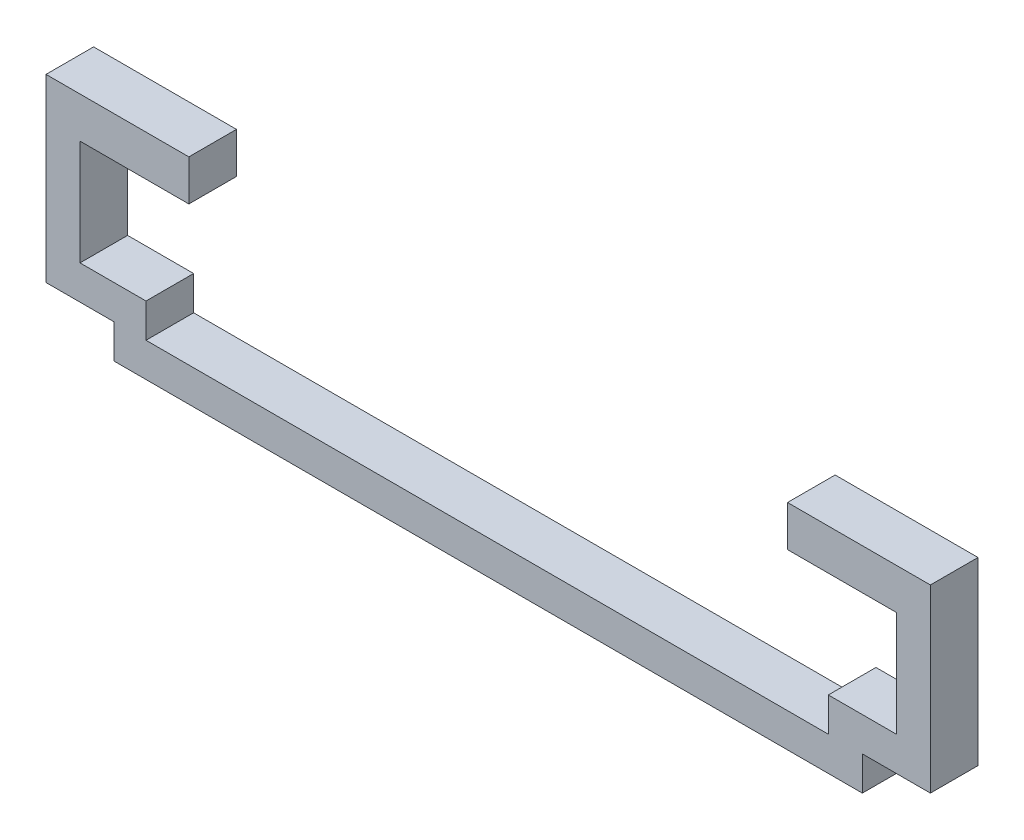
ISO-10303-21;
HEADER;
FILE_DESCRIPTION(('STEP AP214'),'2;1');
FILE_NAME('part.step','',(''),(''),'','','');
FILE_SCHEMA(('AUTOMOTIVE_DESIGN { 1 0 10303 214 1 1 1 1 }'));
ENDSEC;
DATA;
#1=APPLICATION_CONTEXT('core data for automotive mechanical design processes');
#2=APPLICATION_PROTOCOL_DEFINITION('international standard','automotive_design',2000,#1);
#3=PRODUCT_CONTEXT('',#1,'mechanical');
#4=PRODUCT('Part','Part','',(#3));
#5=PRODUCT_RELATED_PRODUCT_CATEGORY('part','',(#4));
#6=PRODUCT_DEFINITION_FORMATION('','',#4);
#7=PRODUCT_DEFINITION_CONTEXT('part definition',#1,'design');
#8=PRODUCT_DEFINITION('design','',#6,#7);
#9=PRODUCT_DEFINITION_SHAPE('','',#8);
#10=(LENGTH_UNIT() NAMED_UNIT(*) SI_UNIT(.MILLI.,.METRE.));
#11=(NAMED_UNIT(*) PLANE_ANGLE_UNIT() SI_UNIT($,.RADIAN.));
#12=(NAMED_UNIT(*) SI_UNIT($,.STERADIAN.) SOLID_ANGLE_UNIT());
#13=UNCERTAINTY_MEASURE_WITH_UNIT(LENGTH_MEASURE(1.E-05),#10,'distance_accuracy_value','');
#14=(GEOMETRIC_REPRESENTATION_CONTEXT(3) GLOBAL_UNCERTAINTY_ASSIGNED_CONTEXT((#13)) GLOBAL_UNIT_ASSIGNED_CONTEXT((#10,
#11,#12)) REPRESENTATION_CONTEXT('',''));
#15=CARTESIAN_POINT('',(0.,0.,0.));
#16=DIRECTION('',(0.,0.,1.));
#17=DIRECTION('',(1.,0.,0.));
#18=AXIS2_PLACEMENT_3D('',#15,#16,#17);
#19=CARTESIAN_POINT('',(55.,-2.5,8.8));
#20=DIRECTION('',(1.,0.,0.));
#21=DIRECTION('',(0.,0.,-1.));
#22=AXIS2_PLACEMENT_3D('',#19,#20,#21);
#23=PLANE('',#22);
#24=DIRECTION('',(0.,1.,0.));
#25=VECTOR('',#24,1.);
#26=CARTESIAN_POINT('',(55.,-2.5,7.));
#27=LINE('',#26,#25);
#28=CARTESIAN_POINT('',(55.,-2.5,7.));
#29=VERTEX_POINT('',#28);
#30=CARTESIAN_POINT('',(55.,2.5,7.));
#31=VERTEX_POINT('',#30);
#32=EDGE_CURVE('E249',#29,#31,#27,.T.);
#33=ORIENTED_EDGE('',*,*,#32,.F.);
#34=DIRECTION('',(0.,0.,-1.));
#35=VECTOR('',#34,1.);
#36=CARTESIAN_POINT('',(55.,-2.5,8.8));
#37=LINE('',#36,#35);
#38=CARTESIAN_POINT('',(55.,-2.5,0.));
#39=VERTEX_POINT('',#38);
#40=EDGE_CURVE('E382',#29,#39,#37,.T.);
#41=ORIENTED_EDGE('',*,*,#40,.T.);
#42=DIRECTION('',(0.,-1.,0.));
#43=VECTOR('',#42,1.);
#44=CARTESIAN_POINT('',(55.,-2.5,0.));
#45=LINE('',#44,#43);
#46=CARTESIAN_POINT('',(55.,2.5,0.));
#47=VERTEX_POINT('',#46);
#48=EDGE_CURVE('E377',#47,#39,#45,.T.);
#49=ORIENTED_EDGE('',*,*,#48,.F.);
#50=DIRECTION('',(0.,0.,1.));
#51=VECTOR('',#50,1.);
#52=CARTESIAN_POINT('',(55.,2.5,0.));
#53=LINE('',#52,#51);
#54=EDGE_CURVE('E342',#47,#31,#53,.T.);
#55=ORIENTED_EDGE('',*,*,#54,.T.);
#56=EDGE_LOOP('',(#33,#41,#49,#55));
#57=FACE_BOUND('',#56,.T.);
#58=ADVANCED_FACE('F39',(#57),#23,.T.);
#59=CARTESIAN_POINT('',(-50.,2.5,8.8));
#60=DIRECTION('',(0.,-1.,0.));
#61=DIRECTION('',(0.,0.,-1.));
#62=AXIS2_PLACEMENT_3D('',#59,#60,#61);
#63=PLANE('',#62);
#64=DIRECTION('',(0.,0.,1.));
#65=VECTOR('',#64,1.);
#66=CARTESIAN_POINT('',(-50.3,2.5,0.));
#67=LINE('',#66,#65);
#68=CARTESIAN_POINT('',(-50.3,2.5,0.));
#69=VERTEX_POINT('',#68);
#70=CARTESIAN_POINT('',(-50.3,2.5,7.));
#71=VERTEX_POINT('',#70);
#72=EDGE_CURVE('E333',#69,#71,#67,.T.);
#73=ORIENTED_EDGE('',*,*,#72,.T.);
#74=DIRECTION('',(-1.,0.,0.));
#75=VECTOR('',#74,1.);
#76=CARTESIAN_POINT('',(50.,2.5,7.));
#77=LINE('',#76,#75);
#78=CARTESIAN_POINT('',(50.,2.5,7.));
#79=VERTEX_POINT('',#78);
#80=EDGE_CURVE('E268',#79,#71,#77,.T.);
#81=ORIENTED_EDGE('',*,*,#80,.F.);
#82=DIRECTION('',(0.,0.,-1.));
#83=VECTOR('',#82,1.);
#84=CARTESIAN_POINT('',(50.,2.5,8.8));
#85=LINE('',#84,#83);
#86=CARTESIAN_POINT('',(50.,2.5,0.));
#87=VERTEX_POINT('',#86);
#88=EDGE_CURVE('E11',#79,#87,#85,.T.);
#89=ORIENTED_EDGE('',*,*,#88,.T.);
#90=DIRECTION('',(-1.,0.,0.));
#91=VECTOR('',#90,1.);
#92=CARTESIAN_POINT('',(-50.,2.5,0.));
#93=LINE('',#92,#91);
#94=EDGE_CURVE('E385',#87,#69,#93,.T.);
#95=ORIENTED_EDGE('',*,*,#94,.T.);
#96=EDGE_LOOP('',(#73,#81,#89,#95));
#97=FACE_BOUND('',#96,.T.);
#98=ADVANCED_FACE('F41',(#97),#63,.F.);
#99=CARTESIAN_POINT('',(-50.,-2.5,8.8));
#100=DIRECTION('',(0.,1.,0.));
#101=DIRECTION('',(0.,0.,1.));
#102=AXIS2_PLACEMENT_3D('',#99,#100,#101);
#103=PLANE('',#102);
#104=ORIENTED_EDGE('',*,*,#40,.F.);
#105=DIRECTION('',(1.,0.,0.));
#106=VECTOR('',#105,1.);
#107=CARTESIAN_POINT('',(-55.,-2.5,7.));
#108=LINE('',#107,#106);
#109=CARTESIAN_POINT('',(-55.,-2.5,7.));
#110=VERTEX_POINT('',#109);
#111=EDGE_CURVE('E246',#110,#29,#108,.T.);
#112=ORIENTED_EDGE('',*,*,#111,.F.);
#113=DIRECTION('',(0.,0.,-1.));
#114=VECTOR('',#113,1.);
#115=CARTESIAN_POINT('',(-55.,-2.5,8.8));
#116=LINE('',#115,#114);
#117=CARTESIAN_POINT('',(-55.,-2.5,0.));
#118=VERTEX_POINT('',#117);
#119=EDGE_CURVE('E367',#110,#118,#116,.T.);
#120=ORIENTED_EDGE('',*,*,#119,.T.);
#121=DIRECTION('',(1.,0.,0.));
#122=VECTOR('',#121,1.);
#123=CARTESIAN_POINT('',(-50.,-2.5,0.));
#124=LINE('',#123,#122);
#125=EDGE_CURVE('E48',#118,#39,#124,.T.);
#126=ORIENTED_EDGE('',*,*,#125,.T.);
#127=EDGE_LOOP('',(#104,#112,#120,#126));
#128=FACE_BOUND('',#127,.T.);
#129=ADVANCED_FACE('F394',(#128),#103,.F.);
#130=CARTESIAN_POINT('',(0.,0.,0.));
#131=DIRECTION('',(0.,0.,1.));
#132=DIRECTION('',(1.,0.,0.));
#133=AXIS2_PLACEMENT_3D('',#130,#131,#132);
#134=PLANE('',#133);
#135=DIRECTION('',(1.,0.,0.));
#136=VECTOR('',#135,1.);
#137=CARTESIAN_POINT('',(65.,23.,0.));
#138=LINE('',#137,#136);
#139=CARTESIAN_POINT('',(44.,23.,0.));
#140=VERTEX_POINT('',#139);
#141=CARTESIAN_POINT('',(60.,23.,0.));
#142=VERTEX_POINT('',#141);
#143=EDGE_CURVE('E282',#140,#142,#138,.T.);
#144=ORIENTED_EDGE('',*,*,#143,.F.);
#145=DIRECTION('',(0.,-1.,0.));
#146=VECTOR('',#145,1.);
#147=CARTESIAN_POINT('',(44.,29.,0.));
#148=LINE('',#147,#146);
#149=CARTESIAN_POINT('',(44.,29.,0.));
#150=VERTEX_POINT('',#149);
#151=EDGE_CURVE('E202',#150,#140,#148,.T.);
#152=ORIENTED_EDGE('',*,*,#151,.F.);
#153=DIRECTION('',(-1.,0.,0.));
#154=VECTOR('',#153,1.);
#155=CARTESIAN_POINT('',(65.,29.,0.));
#156=LINE('',#155,#154);
#157=CARTESIAN_POINT('',(65.,29.,0.));
#158=VERTEX_POINT('',#157);
#159=EDGE_CURVE('E197',#158,#150,#156,.T.);
#160=ORIENTED_EDGE('',*,*,#159,.F.);
#161=DIRECTION('',(0.,1.,0.));
#162=VECTOR('',#161,1.);
#163=CARTESIAN_POINT('',(65.,2.5,0.));
#164=LINE('',#163,#162);
#165=CARTESIAN_POINT('',(65.,2.5,0.));
#166=VERTEX_POINT('',#165);
#167=EDGE_CURVE('E303',#166,#158,#164,.T.);
#168=ORIENTED_EDGE('',*,*,#167,.F.);
#169=DIRECTION('',(1.,0.,0.));
#170=VECTOR('',#169,1.);
#171=CARTESIAN_POINT('',(55.,2.5,0.));
#172=LINE('',#171,#170);
#173=EDGE_CURVE('E337',#47,#166,#172,.T.);
#174=ORIENTED_EDGE('',*,*,#173,.F.);
#175=ORIENTED_EDGE('',*,*,#48,.T.);
#176=ORIENTED_EDGE('',*,*,#125,.F.);
#177=DIRECTION('',(0.,1.,0.));
#178=VECTOR('',#177,1.);
#179=CARTESIAN_POINT('',(-55.,-2.5,0.));
#180=LINE('',#179,#178);
#181=CARTESIAN_POINT('',(-55.,2.5,0.));
#182=VERTEX_POINT('',#181);
#183=EDGE_CURVE('E357',#118,#182,#180,.T.);
#184=ORIENTED_EDGE('',*,*,#183,.T.);
#185=DIRECTION('',(1.,0.,0.));
#186=VECTOR('',#185,1.);
#187=CARTESIAN_POINT('',(-55.,2.5,0.));
#188=LINE('',#187,#186);
#189=CARTESIAN_POINT('',(-65.,2.5,0.));
#190=VERTEX_POINT('',#189);
#191=EDGE_CURVE('E347',#190,#182,#188,.T.);
#192=ORIENTED_EDGE('',*,*,#191,.F.);
#193=DIRECTION('',(0.,-1.,0.));
#194=VECTOR('',#193,1.);
#195=CARTESIAN_POINT('',(-65.,2.5,0.));
#196=LINE('',#195,#194);
#197=CARTESIAN_POINT('',(-65.,29.,0.));
#198=VERTEX_POINT('',#197);
#199=EDGE_CURVE('E318',#198,#190,#196,.T.);
#200=ORIENTED_EDGE('',*,*,#199,.F.);
#201=DIRECTION('',(-1.,0.,0.));
#202=VECTOR('',#201,1.);
#203=CARTESIAN_POINT('',(-65.,29.,0.));
#204=LINE('',#203,#202);
#205=CARTESIAN_POINT('',(-44.,29.,0.));
#206=VERTEX_POINT('',#205);
#207=EDGE_CURVE('E291',#206,#198,#204,.T.);
#208=ORIENTED_EDGE('',*,*,#207,.F.);
#209=DIRECTION('',(0.,1.,0.));
#210=VECTOR('',#209,1.);
#211=CARTESIAN_POINT('',(-44.,29.,0.));
#212=LINE('',#211,#210);
#213=CARTESIAN_POINT('',(-44.,23.,0.));
#214=VERTEX_POINT('',#213);
#215=EDGE_CURVE('E223',#214,#206,#212,.T.);
#216=ORIENTED_EDGE('',*,*,#215,.F.);
#217=DIRECTION('',(1.,0.,0.));
#218=VECTOR('',#217,1.);
#219=CARTESIAN_POINT('',(-65.,23.,0.));
#220=LINE('',#219,#218);
#221=CARTESIAN_POINT('',(-60.,23.,0.));
#222=VERTEX_POINT('',#221);
#223=EDGE_CURVE('E288',#222,#214,#220,.T.);
#224=ORIENTED_EDGE('',*,*,#223,.F.);
#225=DIRECTION('',(0.,1.,0.));
#226=VECTOR('',#225,1.);
#227=CARTESIAN_POINT('',(-60.,2.5,0.));
#228=LINE('',#227,#226);
#229=CARTESIAN_POINT('',(-60.,7.5,0.));
#230=VERTEX_POINT('',#229);
#231=EDGE_CURVE('E311',#230,#222,#228,.T.);
#232=ORIENTED_EDGE('',*,*,#231,.F.);
#233=DIRECTION('',(1.,0.,0.));
#234=VECTOR('',#233,1.);
#235=CARTESIAN_POINT('',(-50.,7.5,0.));
#236=LINE('',#235,#234);
#237=CARTESIAN_POINT('',(-50.3,7.5,0.));
#238=VERTEX_POINT('',#237);
#239=EDGE_CURVE('E363',#230,#238,#236,.T.);
#240=ORIENTED_EDGE('',*,*,#239,.T.);
#241=DIRECTION('',(0.,-1.,0.));
#242=VECTOR('',#241,1.);
#243=CARTESIAN_POINT('',(-50.3,7.5,0.));
#244=LINE('',#243,#242);
#245=EDGE_CURVE('E55',#238,#69,#244,.T.);
#246=ORIENTED_EDGE('',*,*,#245,.T.);
#247=ORIENTED_EDGE('',*,*,#94,.F.);
#248=DIRECTION('',(0.,1.,0.));
#249=VECTOR('',#248,1.);
#250=CARTESIAN_POINT('',(50.,-2.5,0.));
#251=LINE('',#250,#249);
#252=CARTESIAN_POINT('',(50.,7.5,0.));
#253=VERTEX_POINT('',#252);
#254=EDGE_CURVE('E370',#87,#253,#251,.T.);
#255=ORIENTED_EDGE('',*,*,#254,.T.);
#256=DIRECTION('',(1.,0.,0.));
#257=VECTOR('',#256,1.);
#258=CARTESIAN_POINT('',(50.,7.5,0.));
#259=LINE('',#258,#257);
#260=CARTESIAN_POINT('',(60.,7.5,0.));
#261=VERTEX_POINT('',#260);
#262=EDGE_CURVE('E374',#253,#261,#259,.T.);
#263=ORIENTED_EDGE('',*,*,#262,.T.);
#264=DIRECTION('',(0.,-1.,0.));
#265=VECTOR('',#264,1.);
#266=CARTESIAN_POINT('',(60.,2.5,0.));
#267=LINE('',#266,#265);
#268=EDGE_CURVE('E299',#142,#261,#267,.T.);
#269=ORIENTED_EDGE('',*,*,#268,.F.);
#270=EDGE_LOOP('',(#144,#152,#160,#168,#174,#175,#176,#184,#192,#200,#208,#216,#224,#232,#240,
#246,#247,#255,#263,#269));
#271=FACE_BOUND('',#270,.T.);
#272=ADVANCED_FACE('F398',(#271),#134,.F.);
#273=CARTESIAN_POINT('',(50.,-2.5,8.8));
#274=DIRECTION('',(-1.,0.,0.));
#275=DIRECTION('',(0.,0.,1.));
#276=AXIS2_PLACEMENT_3D('',#273,#274,#275);
#277=PLANE('',#276);
#278=DIRECTION('',(0.,-1.,0.));
#279=VECTOR('',#278,1.);
#280=CARTESIAN_POINT('',(50.,7.5,7.));
#281=LINE('',#280,#279);
#282=CARTESIAN_POINT('',(50.,7.5,7.));
#283=VERTEX_POINT('',#282);
#284=EDGE_CURVE('E265',#283,#79,#281,.T.);
#285=ORIENTED_EDGE('',*,*,#284,.F.);
#286=DIRECTION('',(0.,0.,-1.));
#287=VECTOR('',#286,1.);
#288=CARTESIAN_POINT('',(50.,7.5,8.8));
#289=LINE('',#288,#287);
#290=EDGE_CURVE('E381',#283,#253,#289,.T.);
#291=ORIENTED_EDGE('',*,*,#290,.T.);
#292=ORIENTED_EDGE('',*,*,#254,.F.);
#293=ORIENTED_EDGE('',*,*,#88,.F.);
#294=EDGE_LOOP('',(#285,#291,#292,#293));
#295=FACE_BOUND('',#294,.T.);
#296=ADVANCED_FACE('F440',(#295),#277,.T.);
#297=CARTESIAN_POINT('',(50.,7.5,8.8));
#298=DIRECTION('',(0.,1.,0.));
#299=DIRECTION('',(0.,0.,1.));
#300=AXIS2_PLACEMENT_3D('',#297,#298,#299);
#301=PLANE('',#300);
#302=DIRECTION('',(-1.,0.,0.));
#303=VECTOR('',#302,1.);
#304=CARTESIAN_POINT('',(60.,7.5,7.));
#305=LINE('',#304,#303);
#306=CARTESIAN_POINT('',(60.,7.5,7.));
#307=VERTEX_POINT('',#306);
#308=EDGE_CURVE('E262',#307,#283,#305,.T.);
#309=ORIENTED_EDGE('',*,*,#308,.F.);
#310=DIRECTION('',(0.,0.,1.));
#311=VECTOR('',#310,1.);
#312=CARTESIAN_POINT('',(60.,7.5,0.));
#313=LINE('',#312,#311);
#314=EDGE_CURVE('E343',#261,#307,#313,.T.);
#315=ORIENTED_EDGE('',*,*,#314,.F.);
#316=ORIENTED_EDGE('',*,*,#262,.F.);
#317=ORIENTED_EDGE('',*,*,#290,.F.);
#318=EDGE_LOOP('',(#309,#315,#316,#317));
#319=FACE_BOUND('',#318,.T.);
#320=ADVANCED_FACE('F444',(#319),#301,.T.);
#321=CARTESIAN_POINT('',(-50.,7.5,8.8));
#322=DIRECTION('',(0.,1.,0.));
#323=DIRECTION('',(0.,0.,1.));
#324=AXIS2_PLACEMENT_3D('',#321,#322,#323);
#325=PLANE('',#324);
#326=DIRECTION('',(-1.,0.,0.));
#327=VECTOR('',#326,1.);
#328=CARTESIAN_POINT('',(-50.3,7.5,7.));
#329=LINE('',#328,#327);
#330=CARTESIAN_POINT('',(-50.3,7.5,7.));
#331=VERTEX_POINT('',#330);
#332=CARTESIAN_POINT('',(-60.,7.5,7.));
#333=VERTEX_POINT('',#332);
#334=EDGE_CURVE('E274',#331,#333,#329,.T.);
#335=ORIENTED_EDGE('',*,*,#334,.F.);
#336=DIRECTION('',(0.,0.,1.));
#337=VECTOR('',#336,1.);
#338=CARTESIAN_POINT('',(-50.3,7.5,0.));
#339=LINE('',#338,#337);
#340=EDGE_CURVE('E332',#238,#331,#339,.T.);
#341=ORIENTED_EDGE('',*,*,#340,.F.);
#342=ORIENTED_EDGE('',*,*,#239,.F.);
#343=DIRECTION('',(0.,0.,1.));
#344=VECTOR('',#343,1.);
#345=CARTESIAN_POINT('',(-60.,7.5,0.));
#346=LINE('',#345,#344);
#347=EDGE_CURVE('E354',#230,#333,#346,.T.);
#348=ORIENTED_EDGE('',*,*,#347,.T.);
#349=EDGE_LOOP('',(#335,#341,#342,#348));
#350=FACE_BOUND('',#349,.T.);
#351=ADVANCED_FACE('F429',(#350),#325,.T.);
#352=CARTESIAN_POINT('',(-55.,-2.5,8.8));
#353=DIRECTION('',(-1.,0.,0.));
#354=DIRECTION('',(0.,0.,1.));
#355=AXIS2_PLACEMENT_3D('',#352,#353,#354);
#356=PLANE('',#355);
#357=DIRECTION('',(0.,-1.,0.));
#358=VECTOR('',#357,1.);
#359=CARTESIAN_POINT('',(-55.,2.5,7.));
#360=LINE('',#359,#358);
#361=CARTESIAN_POINT('',(-55.,2.5,7.));
#362=VERTEX_POINT('',#361);
#363=EDGE_CURVE('E243',#362,#110,#360,.T.);
#364=ORIENTED_EDGE('',*,*,#363,.F.);
#365=DIRECTION('',(0.,0.,1.));
#366=VECTOR('',#365,1.);
#367=CARTESIAN_POINT('',(-55.,2.5,0.));
#368=LINE('',#367,#366);
#369=EDGE_CURVE('E63',#182,#362,#368,.T.);
#370=ORIENTED_EDGE('',*,*,#369,.F.);
#371=ORIENTED_EDGE('',*,*,#183,.F.);
#372=ORIENTED_EDGE('',*,*,#119,.F.);
#373=EDGE_LOOP('',(#364,#370,#371,#372));
#374=FACE_BOUND('',#373,.T.);
#375=ADVANCED_FACE('F401',(#374),#356,.T.);
#376=CARTESIAN_POINT('',(-55.,2.5,0.));
#377=DIRECTION('',(0.,-1.,0.));
#378=DIRECTION('',(0.,0.,-1.));
#379=AXIS2_PLACEMENT_3D('',#376,#377,#378);
#380=PLANE('',#379);
#381=DIRECTION('',(1.,0.,0.));
#382=VECTOR('',#381,1.);
#383=CARTESIAN_POINT('',(-65.,2.5,7.));
#384=LINE('',#383,#382);
#385=CARTESIAN_POINT('',(-65.,2.5,7.));
#386=VERTEX_POINT('',#385);
#387=EDGE_CURVE('E240',#386,#362,#384,.T.);
#388=ORIENTED_EDGE('',*,*,#387,.F.);
#389=DIRECTION('',(0.,0.,1.));
#390=VECTOR('',#389,1.);
#391=CARTESIAN_POINT('',(-65.,2.5,0.));
#392=LINE('',#391,#390);
#393=EDGE_CURVE('E323',#190,#386,#392,.T.);
#394=ORIENTED_EDGE('',*,*,#393,.F.);
#395=ORIENTED_EDGE('',*,*,#191,.T.);
#396=ORIENTED_EDGE('',*,*,#369,.T.);
#397=EDGE_LOOP('',(#388,#394,#395,#396));
#398=FACE_BOUND('',#397,.T.);
#399=ADVANCED_FACE('F404',(#398),#380,.T.);
#400=CARTESIAN_POINT('',(55.,2.5,0.));
#401=DIRECTION('',(0.,-1.,0.));
#402=DIRECTION('',(0.,0.,-1.));
#403=AXIS2_PLACEMENT_3D('',#400,#401,#402);
#404=PLANE('',#403);
#405=DIRECTION('',(1.,0.,0.));
#406=VECTOR('',#405,1.);
#407=CARTESIAN_POINT('',(55.,2.5,7.));
#408=LINE('',#407,#406);
#409=CARTESIAN_POINT('',(65.,2.5,7.));
#410=VERTEX_POINT('',#409);
#411=EDGE_CURVE('E252',#31,#410,#408,.T.);
#412=ORIENTED_EDGE('',*,*,#411,.F.);
#413=ORIENTED_EDGE('',*,*,#54,.F.);
#414=ORIENTED_EDGE('',*,*,#173,.T.);
#415=DIRECTION('',(0.,0.,1.));
#416=VECTOR('',#415,1.);
#417=CARTESIAN_POINT('',(65.,2.5,0.));
#418=LINE('',#417,#416);
#419=EDGE_CURVE('E306',#166,#410,#418,.T.);
#420=ORIENTED_EDGE('',*,*,#419,.T.);
#421=EDGE_LOOP('',(#412,#413,#414,#420));
#422=FACE_BOUND('',#421,.T.);
#423=ADVANCED_FACE('F511',(#422),#404,.T.);
#424=CARTESIAN_POINT('',(-50.3,7.5,0.));
#425=DIRECTION('',(-1.,0.,0.));
#426=DIRECTION('',(0.,0.,1.));
#427=AXIS2_PLACEMENT_3D('',#424,#425,#426);
#428=PLANE('',#427);
#429=ORIENTED_EDGE('',*,*,#340,.T.);
#430=DIRECTION('',(0.,1.,0.));
#431=VECTOR('',#430,1.);
#432=CARTESIAN_POINT('',(-50.3,2.5,7.));
#433=LINE('',#432,#431);
#434=EDGE_CURVE('E271',#71,#331,#433,.T.);
#435=ORIENTED_EDGE('',*,*,#434,.F.);
#436=ORIENTED_EDGE('',*,*,#72,.F.);
#437=ORIENTED_EDGE('',*,*,#245,.F.);
#438=EDGE_LOOP('',(#429,#435,#436,#437));
#439=FACE_BOUND('',#438,.T.);
#440=ADVANCED_FACE('F437',(#439),#428,.F.);
#441=CARTESIAN_POINT('',(-60.,2.5,0.));
#442=DIRECTION('',(1.,0.,0.));
#443=DIRECTION('',(0.,0.,-1.));
#444=AXIS2_PLACEMENT_3D('',#441,#442,#443);
#445=PLANE('',#444);
#446=DIRECTION('',(0.,1.,0.));
#447=VECTOR('',#446,1.);
#448=CARTESIAN_POINT('',(-60.,7.5,7.));
#449=LINE('',#448,#447);
#450=CARTESIAN_POINT('',(-60.,23.,7.));
#451=VERTEX_POINT('',#450);
#452=EDGE_CURVE('E277',#333,#451,#449,.T.);
#453=ORIENTED_EDGE('',*,*,#452,.F.);
#454=ORIENTED_EDGE('',*,*,#347,.F.);
#455=ORIENTED_EDGE('',*,*,#231,.T.);
#456=DIRECTION('',(0.,0.,1.));
#457=VECTOR('',#456,1.);
#458=CARTESIAN_POINT('',(-60.,23.,0.));
#459=LINE('',#458,#457);
#460=EDGE_CURVE('E322',#222,#451,#459,.T.);
#461=ORIENTED_EDGE('',*,*,#460,.T.);
#462=EDGE_LOOP('',(#453,#454,#455,#461));
#463=FACE_BOUND('',#462,.T.);
#464=ADVANCED_FACE('F426',(#463),#445,.T.);
#465=CARTESIAN_POINT('',(-65.,2.5,0.));
#466=DIRECTION('',(-1.,0.,0.));
#467=DIRECTION('',(0.,0.,1.));
#468=AXIS2_PLACEMENT_3D('',#465,#466,#467);
#469=PLANE('',#468);
#470=DIRECTION('',(0.,-1.,0.));
#471=VECTOR('',#470,1.);
#472=CARTESIAN_POINT('',(-65.,29.,7.));
#473=LINE('',#472,#471);
#474=CARTESIAN_POINT('',(-65.,29.,7.));
#475=VERTEX_POINT('',#474);
#476=EDGE_CURVE('E237',#475,#386,#473,.T.);
#477=ORIENTED_EDGE('',*,*,#476,.F.);
#478=DIRECTION('',(0.,0.,1.));
#479=VECTOR('',#478,1.);
#480=CARTESIAN_POINT('',(-65.,29.,0.));
#481=LINE('',#480,#479);
#482=EDGE_CURVE('E295',#198,#475,#481,.T.);
#483=ORIENTED_EDGE('',*,*,#482,.F.);
#484=ORIENTED_EDGE('',*,*,#199,.T.);
#485=ORIENTED_EDGE('',*,*,#393,.T.);
#486=EDGE_LOOP('',(#477,#483,#484,#485));
#487=FACE_BOUND('',#486,.T.);
#488=ADVANCED_FACE('F410',(#487),#469,.T.);
#489=CARTESIAN_POINT('',(60.,2.5,0.));
#490=DIRECTION('',(-1.,0.,0.));
#491=DIRECTION('',(0.,0.,1.));
#492=AXIS2_PLACEMENT_3D('',#489,#490,#491);
#493=PLANE('',#492);
#494=DIRECTION('',(0.,-1.,0.));
#495=VECTOR('',#494,1.);
#496=CARTESIAN_POINT('',(60.,23.,7.));
#497=LINE('',#496,#495);
#498=CARTESIAN_POINT('',(60.,23.,7.));
#499=VERTEX_POINT('',#498);
#500=EDGE_CURVE('E259',#499,#307,#497,.T.);
#501=ORIENTED_EDGE('',*,*,#500,.F.);
#502=DIRECTION('',(0.,0.,1.));
#503=VECTOR('',#502,1.);
#504=CARTESIAN_POINT('',(60.,23.,0.));
#505=LINE('',#504,#503);
#506=EDGE_CURVE('E307',#142,#499,#505,.T.);
#507=ORIENTED_EDGE('',*,*,#506,.F.);
#508=ORIENTED_EDGE('',*,*,#268,.T.);
#509=ORIENTED_EDGE('',*,*,#314,.T.);
#510=EDGE_LOOP('',(#501,#507,#508,#509));
#511=FACE_BOUND('',#510,.T.);
#512=ADVANCED_FACE('F450',(#511),#493,.T.);
#513=CARTESIAN_POINT('',(65.,2.5,0.));
#514=DIRECTION('',(1.,0.,0.));
#515=DIRECTION('',(0.,0.,-1.));
#516=AXIS2_PLACEMENT_3D('',#513,#514,#515);
#517=PLANE('',#516);
#518=DIRECTION('',(0.,1.,0.));
#519=VECTOR('',#518,1.);
#520=CARTESIAN_POINT('',(65.,2.5,7.));
#521=LINE('',#520,#519);
#522=CARTESIAN_POINT('',(65.,29.,7.));
#523=VERTEX_POINT('',#522);
#524=EDGE_CURVE('E186',#410,#523,#521,.T.);
#525=ORIENTED_EDGE('',*,*,#524,.F.);
#526=ORIENTED_EDGE('',*,*,#419,.F.);
#527=ORIENTED_EDGE('',*,*,#167,.T.);
#528=DIRECTION('',(0.,0.,1.));
#529=VECTOR('',#528,1.);
#530=CARTESIAN_POINT('',(65.,29.,0.));
#531=LINE('',#530,#529);
#532=EDGE_CURVE('E285',#158,#523,#531,.T.);
#533=ORIENTED_EDGE('',*,*,#532,.T.);
#534=EDGE_LOOP('',(#525,#526,#527,#533));
#535=FACE_BOUND('',#534,.T.);
#536=ADVANCED_FACE('F543',(#535),#517,.T.);
#537=CARTESIAN_POINT('',(-65.,29.,0.));
#538=DIRECTION('',(0.,1.,0.));
#539=DIRECTION('',(0.,0.,1.));
#540=AXIS2_PLACEMENT_3D('',#537,#538,#539);
#541=PLANE('',#540);
#542=DIRECTION('',(-1.,0.,0.));
#543=VECTOR('',#542,1.);
#544=CARTESIAN_POINT('',(-50.,29.,7.));
#545=LINE('',#544,#543);
#546=CARTESIAN_POINT('',(-44.,29.,7.));
#547=VERTEX_POINT('',#546);
#548=EDGE_CURVE('E234',#547,#475,#545,.T.);
#549=ORIENTED_EDGE('',*,*,#548,.F.);
#550=DIRECTION('',(0.,0.,1.));
#551=VECTOR('',#550,1.);
#552=CARTESIAN_POINT('',(-44.,29.,7.));
#553=LINE('',#552,#551);
#554=EDGE_CURVE('E227',#206,#547,#553,.T.);
#555=ORIENTED_EDGE('',*,*,#554,.F.);
#556=ORIENTED_EDGE('',*,*,#207,.T.);
#557=ORIENTED_EDGE('',*,*,#482,.T.);
#558=EDGE_LOOP('',(#549,#555,#556,#557));
#559=FACE_BOUND('',#558,.T.);
#560=ADVANCED_FACE('F413',(#559),#541,.T.);
#561=CARTESIAN_POINT('',(-65.,23.,0.));
#562=DIRECTION('',(0.,-1.,0.));
#563=DIRECTION('',(0.,0.,-1.));
#564=AXIS2_PLACEMENT_3D('',#561,#562,#563);
#565=PLANE('',#564);
#566=DIRECTION('',(1.,0.,0.));
#567=VECTOR('',#566,1.);
#568=CARTESIAN_POINT('',(-60.,23.,7.));
#569=LINE('',#568,#567);
#570=CARTESIAN_POINT('',(-44.,23.,7.));
#571=VERTEX_POINT('',#570);
#572=EDGE_CURVE('E231',#451,#571,#569,.T.);
#573=ORIENTED_EDGE('',*,*,#572,.F.);
#574=ORIENTED_EDGE('',*,*,#460,.F.);
#575=ORIENTED_EDGE('',*,*,#223,.T.);
#576=DIRECTION('',(0.,0.,-1.));
#577=VECTOR('',#576,1.);
#578=CARTESIAN_POINT('',(-44.,23.,7.));
#579=LINE('',#578,#577);
#580=EDGE_CURVE('E219',#571,#214,#579,.T.);
#581=ORIENTED_EDGE('',*,*,#580,.F.);
#582=EDGE_LOOP('',(#573,#574,#575,#581));
#583=FACE_BOUND('',#582,.T.);
#584=ADVANCED_FACE('F421',(#583),#565,.T.);
#585=CARTESIAN_POINT('',(65.,23.,0.));
#586=DIRECTION('',(0.,-1.,0.));
#587=DIRECTION('',(0.,0.,-1.));
#588=AXIS2_PLACEMENT_3D('',#585,#586,#587);
#589=PLANE('',#588);
#590=DIRECTION('',(1.,0.,0.));
#591=VECTOR('',#590,1.);
#592=CARTESIAN_POINT('',(51.5,23.,7.));
#593=LINE('',#592,#591);
#594=CARTESIAN_POINT('',(44.,23.,7.));
#595=VERTEX_POINT('',#594);
#596=EDGE_CURVE('E191',#595,#499,#593,.T.);
#597=ORIENTED_EDGE('',*,*,#596,.F.);
#598=DIRECTION('',(0.,0.,1.));
#599=VECTOR('',#598,1.);
#600=CARTESIAN_POINT('',(44.,23.,7.));
#601=LINE('',#600,#599);
#602=EDGE_CURVE('E207',#140,#595,#601,.T.);
#603=ORIENTED_EDGE('',*,*,#602,.F.);
#604=ORIENTED_EDGE('',*,*,#143,.T.);
#605=ORIENTED_EDGE('',*,*,#506,.T.);
#606=EDGE_LOOP('',(#597,#603,#604,#605));
#607=FACE_BOUND('',#606,.T.);
#608=ADVANCED_FACE('F452',(#607),#589,.T.);
#609=CARTESIAN_POINT('',(65.,29.,0.));
#610=DIRECTION('',(0.,1.,0.));
#611=DIRECTION('',(-1.,0.,0.));
#612=AXIS2_PLACEMENT_3D('',#609,#610,#611);
#613=PLANE('',#612);
#614=DIRECTION('',(-1.,0.,0.));
#615=VECTOR('',#614,1.);
#616=CARTESIAN_POINT('',(65.,29.,7.));
#617=LINE('',#616,#615);
#618=CARTESIAN_POINT('',(44.,29.,7.));
#619=VERTEX_POINT('',#618);
#620=EDGE_CURVE('E180',#523,#619,#617,.T.);
#621=ORIENTED_EDGE('',*,*,#620,.F.);
#622=ORIENTED_EDGE('',*,*,#532,.F.);
#623=ORIENTED_EDGE('',*,*,#159,.T.);
#624=DIRECTION('',(0.,0.,-1.));
#625=VECTOR('',#624,1.);
#626=CARTESIAN_POINT('',(44.,29.,7.));
#627=LINE('',#626,#625);
#628=EDGE_CURVE('E194',#619,#150,#627,.T.);
#629=ORIENTED_EDGE('',*,*,#628,.F.);
#630=EDGE_LOOP('',(#621,#622,#623,#629));
#631=FACE_BOUND('',#630,.T.);
#632=ADVANCED_FACE('F195',(#631),#613,.T.);
#633=CARTESIAN_POINT('',(0.,0.,7.));
#634=DIRECTION('',(0.,0.,-1.));
#635=DIRECTION('',(-1.,0.,0.));
#636=AXIS2_PLACEMENT_3D('',#633,#634,#635);
#637=PLANE('',#636);
#638=ORIENTED_EDGE('',*,*,#620,.T.);
#639=DIRECTION('',(0.,1.,0.));
#640=VECTOR('',#639,1.);
#641=CARTESIAN_POINT('',(44.,29.,7.));
#642=LINE('',#641,#640);
#643=EDGE_CURVE('E184',#595,#619,#642,.T.);
#644=ORIENTED_EDGE('',*,*,#643,.F.);
#645=ORIENTED_EDGE('',*,*,#596,.T.);
#646=ORIENTED_EDGE('',*,*,#500,.T.);
#647=ORIENTED_EDGE('',*,*,#308,.T.);
#648=ORIENTED_EDGE('',*,*,#284,.T.);
#649=ORIENTED_EDGE('',*,*,#80,.T.);
#650=ORIENTED_EDGE('',*,*,#434,.T.);
#651=ORIENTED_EDGE('',*,*,#334,.T.);
#652=ORIENTED_EDGE('',*,*,#452,.T.);
#653=ORIENTED_EDGE('',*,*,#572,.T.);
#654=DIRECTION('',(0.,-1.,0.));
#655=VECTOR('',#654,1.);
#656=CARTESIAN_POINT('',(-44.,29.,7.));
#657=LINE('',#656,#655);
#658=EDGE_CURVE('E215',#547,#571,#657,.T.);
#659=ORIENTED_EDGE('',*,*,#658,.F.);
#660=ORIENTED_EDGE('',*,*,#548,.T.);
#661=ORIENTED_EDGE('',*,*,#476,.T.);
#662=ORIENTED_EDGE('',*,*,#387,.T.);
#663=ORIENTED_EDGE('',*,*,#363,.T.);
#664=ORIENTED_EDGE('',*,*,#111,.T.);
#665=ORIENTED_EDGE('',*,*,#32,.T.);
#666=ORIENTED_EDGE('',*,*,#411,.T.);
#667=ORIENTED_EDGE('',*,*,#524,.T.);
#668=EDGE_LOOP('',(#638,#644,#645,#646,#647,#648,#649,#650,#651,#652,#653,#659,#660,#661,#662,
#663,#664,#665,#666,#667));
#669=FACE_BOUND('',#668,.T.);
#670=ADVANCED_FACE('F182',(#669),#637,.F.);
#671=CARTESIAN_POINT('',(-44.,0.,0.));
#672=DIRECTION('',(1.,0.,0.));
#673=DIRECTION('',(0.,0.,-1.));
#674=AXIS2_PLACEMENT_3D('',#671,#672,#673);
#675=PLANE('',#674);
#676=ORIENTED_EDGE('',*,*,#658,.T.);
#677=ORIENTED_EDGE('',*,*,#580,.T.);
#678=ORIENTED_EDGE('',*,*,#215,.T.);
#679=ORIENTED_EDGE('',*,*,#554,.T.);
#680=EDGE_LOOP('',(#676,#677,#678,#679));
#681=FACE_BOUND('',#680,.T.);
#682=ADVANCED_FACE('F416',(#681),#675,.T.);
#683=CARTESIAN_POINT('',(44.,0.,0.));
#684=DIRECTION('',(1.,0.,0.));
#685=DIRECTION('',(0.,0.,-1.));
#686=AXIS2_PLACEMENT_3D('',#683,#684,#685);
#687=PLANE('',#686);
#688=ORIENTED_EDGE('',*,*,#643,.T.);
#689=ORIENTED_EDGE('',*,*,#628,.T.);
#690=ORIENTED_EDGE('',*,*,#151,.T.);
#691=ORIENTED_EDGE('',*,*,#602,.T.);
#692=EDGE_LOOP('',(#688,#689,#690,#691));
#693=FACE_BOUND('',#692,.T.);
#694=ADVANCED_FACE('F205',(#693),#687,.F.);
#695=CLOSED_SHELL('',(#58,#98,#129,#272,#296,#320,#351,#375,#399,#423,#440,#464,#488,#512,#536,
#560,#584,#608,#632,#670,#682,#694));
#696=MANIFOLD_SOLID_BREP('B2',#695);
#697=ADVANCED_BREP_SHAPE_REPRESENTATION('',(#18,#696),#14);
#698=SHAPE_DEFINITION_REPRESENTATION(#9,#697);
ENDSEC;
END-ISO-10303-21;
